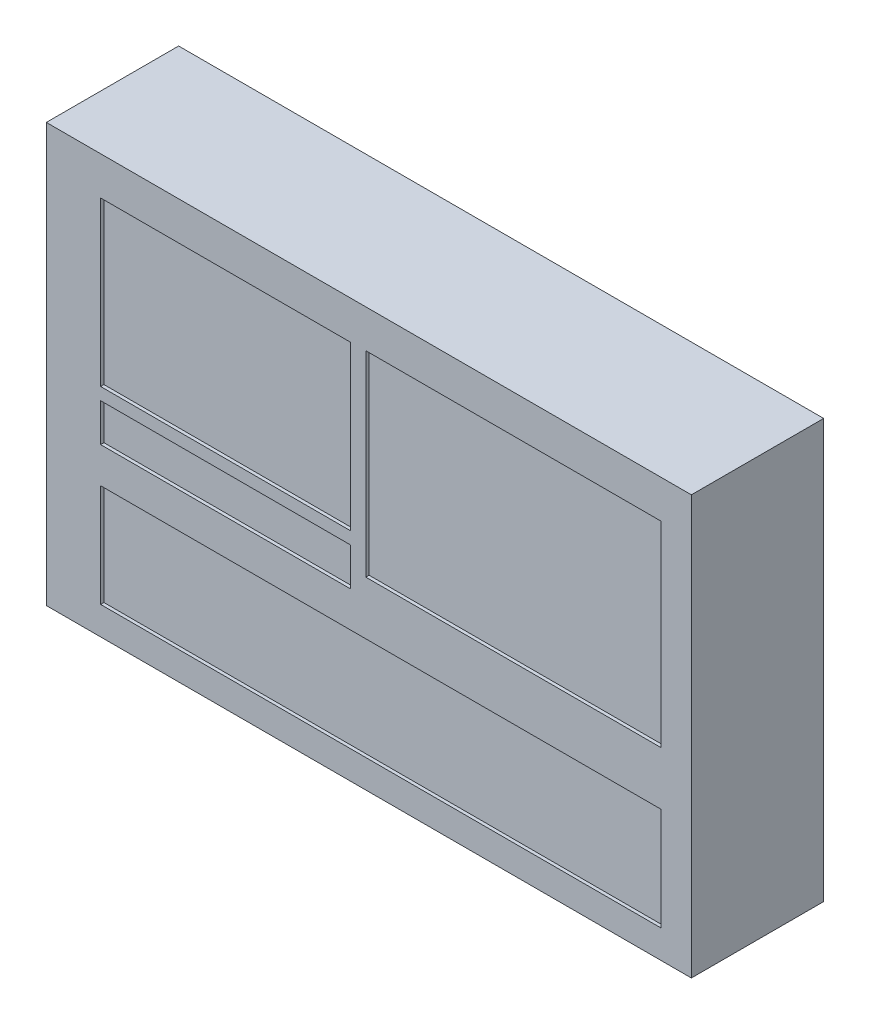
ISO-10303-21;
HEADER;
FILE_DESCRIPTION(('STEP AP214'),'2;1');
FILE_NAME('part.step','',(''),(''),'','','');
FILE_SCHEMA(('AUTOMOTIVE_DESIGN { 1 0 10303 214 1 1 1 1 }'));
ENDSEC;
DATA;
#1=APPLICATION_CONTEXT('core data for automotive mechanical design processes');
#2=APPLICATION_PROTOCOL_DEFINITION('international standard','automotive_design',2000,#1);
#3=PRODUCT_CONTEXT('',#1,'mechanical');
#4=PRODUCT('Part','Part','',(#3));
#5=PRODUCT_RELATED_PRODUCT_CATEGORY('part','',(#4));
#6=PRODUCT_DEFINITION_FORMATION('','',#4);
#7=PRODUCT_DEFINITION_CONTEXT('part definition',#1,'design');
#8=PRODUCT_DEFINITION('design','',#6,#7);
#9=PRODUCT_DEFINITION_SHAPE('','',#8);
#10=(LENGTH_UNIT() NAMED_UNIT(*) SI_UNIT(.MILLI.,.METRE.));
#11=(NAMED_UNIT(*) PLANE_ANGLE_UNIT() SI_UNIT($,.RADIAN.));
#12=(NAMED_UNIT(*) SI_UNIT($,.STERADIAN.) SOLID_ANGLE_UNIT());
#13=UNCERTAINTY_MEASURE_WITH_UNIT(LENGTH_MEASURE(1.E-05),#10,'distance_accuracy_value','');
#14=(GEOMETRIC_REPRESENTATION_CONTEXT(3) GLOBAL_UNCERTAINTY_ASSIGNED_CONTEXT((#13)) GLOBAL_UNIT_ASSIGNED_CONTEXT((#10,
#11,#12)) REPRESENTATION_CONTEXT('',''));
#15=CARTESIAN_POINT('',(0.,0.,0.));
#16=DIRECTION('',(0.,0.,1.));
#17=DIRECTION('',(1.,0.,0.));
#18=AXIS2_PLACEMENT_3D('',#15,#16,#17);
#19=CARTESIAN_POINT('',(-272.368932038835,127.47572815534,80.));
#20=DIRECTION('',(1.,0.,0.));
#21=DIRECTION('',(0.,1.,0.));
#22=AXIS2_PLACEMENT_3D('',#19,#20,#21);
#23=PLANE('',#22);
#24=DIRECTION('',(0.,-1.,0.));
#25=VECTOR('',#24,1.);
#26=CARTESIAN_POINT('',(-272.368932038835,127.47572815534,0.));
#27=LINE('',#26,#25);
#28=CARTESIAN_POINT('',(-272.368932038835,127.47572815534,0.));
#29=VERTEX_POINT('',#28);
#30=CARTESIAN_POINT('',(-272.368932038835,-125.52427184466,0.));
#31=VERTEX_POINT('',#30);
#32=EDGE_CURVE('E351',#29,#31,#27,.T.);
#33=ORIENTED_EDGE('',*,*,#32,.T.);
#34=DIRECTION('',(0.,0.,-1.));
#35=VECTOR('',#34,1.);
#36=CARTESIAN_POINT('',(-272.368932038835,-125.52427184466,80.));
#37=LINE('',#36,#35);
#38=CARTESIAN_POINT('',(-272.368932038835,-125.52427184466,80.));
#39=VERTEX_POINT('',#38);
#40=EDGE_CURVE('E11',#39,#31,#37,.T.);
#41=ORIENTED_EDGE('',*,*,#40,.F.);
#42=DIRECTION('',(0.,-1.,0.));
#43=VECTOR('',#42,1.);
#44=CARTESIAN_POINT('',(-272.368932038835,127.47572815534,80.));
#45=LINE('',#44,#43);
#46=CARTESIAN_POINT('',(-272.368932038835,127.47572815534,80.));
#47=VERTEX_POINT('',#46);
#48=EDGE_CURVE('E361',#47,#39,#45,.T.);
#49=ORIENTED_EDGE('',*,*,#48,.F.);
#50=DIRECTION('',(0.,0.,-1.));
#51=VECTOR('',#50,1.);
#52=CARTESIAN_POINT('',(-272.368932038835,127.47572815534,80.));
#53=LINE('',#52,#51);
#54=EDGE_CURVE('E375',#47,#29,#53,.T.);
#55=ORIENTED_EDGE('',*,*,#54,.T.);
#56=EDGE_LOOP('',(#33,#41,#49,#55));
#57=FACE_BOUND('',#56,.T.);
#58=ADVANCED_FACE('F41',(#57),#23,.F.);
#59=CARTESIAN_POINT('',(-272.368932038835,-125.52427184466,80.));
#60=DIRECTION('',(0.,1.,0.));
#61=DIRECTION('',(0.,0.,1.));
#62=AXIS2_PLACEMENT_3D('',#59,#60,#61);
#63=PLANE('',#62);
#64=DIRECTION('',(1.,0.,0.));
#65=VECTOR('',#64,1.);
#66=CARTESIAN_POINT('',(-272.368932038835,-125.52427184466,0.));
#67=LINE('',#66,#65);
#68=CARTESIAN_POINT('',(117.631067961165,-125.52427184466,0.));
#69=VERTEX_POINT('',#68);
#70=EDGE_CURVE('E379',#31,#69,#67,.T.);
#71=ORIENTED_EDGE('',*,*,#70,.T.);
#72=DIRECTION('',(0.,0.,-1.));
#73=VECTOR('',#72,1.);
#74=CARTESIAN_POINT('',(117.631067961165,-125.52427184466,80.));
#75=LINE('',#74,#73);
#76=CARTESIAN_POINT('',(117.631067961165,-125.52427184466,80.));
#77=VERTEX_POINT('',#76);
#78=EDGE_CURVE('E49',#77,#69,#75,.T.);
#79=ORIENTED_EDGE('',*,*,#78,.F.);
#80=DIRECTION('',(1.,0.,0.));
#81=VECTOR('',#80,1.);
#82=CARTESIAN_POINT('',(-272.368932038835,-125.52427184466,80.));
#83=LINE('',#82,#81);
#84=EDGE_CURVE('E365',#39,#77,#83,.T.);
#85=ORIENTED_EDGE('',*,*,#84,.F.);
#86=ORIENTED_EDGE('',*,*,#40,.T.);
#87=EDGE_LOOP('',(#71,#79,#85,#86));
#88=FACE_BOUND('',#87,.T.);
#89=ADVANCED_FACE('F415',(#88),#63,.F.);
#90=CARTESIAN_POINT('',(117.631067961165,127.47572815534,80.));
#91=DIRECTION('',(-1.,0.,0.));
#92=DIRECTION('',(0.,-1.,0.));
#93=AXIS2_PLACEMENT_3D('',#90,#91,#92);
#94=PLANE('',#93);
#95=DIRECTION('',(0.,1.,0.));
#96=VECTOR('',#95,1.);
#97=CARTESIAN_POINT('',(117.631067961165,127.47572815534,0.));
#98=LINE('',#97,#96);
#99=CARTESIAN_POINT('',(117.631067961165,127.47572815534,0.));
#100=VERTEX_POINT('',#99);
#101=EDGE_CURVE('E382',#69,#100,#98,.T.);
#102=ORIENTED_EDGE('',*,*,#101,.T.);
#103=DIRECTION('',(0.,0.,-1.));
#104=VECTOR('',#103,1.);
#105=CARTESIAN_POINT('',(117.631067961165,127.47572815534,80.));
#106=LINE('',#105,#104);
#107=CARTESIAN_POINT('',(117.631067961165,127.47572815534,80.));
#108=VERTEX_POINT('',#107);
#109=EDGE_CURVE('E390',#108,#100,#106,.T.);
#110=ORIENTED_EDGE('',*,*,#109,.F.);
#111=DIRECTION('',(0.,1.,0.));
#112=VECTOR('',#111,1.);
#113=CARTESIAN_POINT('',(117.631067961165,127.47572815534,80.));
#114=LINE('',#113,#112);
#115=EDGE_CURVE('E369',#77,#108,#114,.T.);
#116=ORIENTED_EDGE('',*,*,#115,.F.);
#117=ORIENTED_EDGE('',*,*,#78,.T.);
#118=EDGE_LOOP('',(#102,#110,#116,#117));
#119=FACE_BOUND('',#118,.T.);
#120=ADVANCED_FACE('F399',(#119),#94,.F.);
#121=CARTESIAN_POINT('',(-272.368932038835,127.47572815534,80.));
#122=DIRECTION('',(0.,-1.,0.));
#123=DIRECTION('',(0.,0.,-1.));
#124=AXIS2_PLACEMENT_3D('',#121,#122,#123);
#125=PLANE('',#124);
#126=DIRECTION('',(-1.,0.,0.));
#127=VECTOR('',#126,1.);
#128=CARTESIAN_POINT('',(-272.368932038835,127.47572815534,0.));
#129=LINE('',#128,#127);
#130=EDGE_CURVE('E366',#100,#29,#129,.T.);
#131=ORIENTED_EDGE('',*,*,#130,.T.);
#132=ORIENTED_EDGE('',*,*,#54,.F.);
#133=DIRECTION('',(-1.,0.,0.));
#134=VECTOR('',#133,1.);
#135=CARTESIAN_POINT('',(-272.368932038835,127.47572815534,80.));
#136=LINE('',#135,#134);
#137=EDGE_CURVE('E372',#108,#47,#136,.T.);
#138=ORIENTED_EDGE('',*,*,#137,.F.);
#139=ORIENTED_EDGE('',*,*,#109,.T.);
#140=EDGE_LOOP('',(#131,#132,#138,#139));
#141=FACE_BOUND('',#140,.T.);
#142=ADVANCED_FACE('F408',(#141),#125,.F.);
#143=CARTESIAN_POINT('',(0.,0.,80.));
#144=DIRECTION('',(0.,0.,1.));
#145=DIRECTION('',(1.,0.,0.));
#146=AXIS2_PLACEMENT_3D('',#143,#144,#145);
#147=PLANE('',#146);
#148=DIRECTION('',(0.,-1.,0.));
#149=VECTOR('',#148,1.);
#150=CARTESIAN_POINT('',(-79.2244882467299,104.51576455588,80.));
#151=LINE('',#150,#149);
#152=CARTESIAN_POINT('',(-79.2244882467299,104.51576455588,80.));
#153=VERTEX_POINT('',#152);
#154=CARTESIAN_POINT('',(-79.2244882467299,-14.0542771286093,80.));
#155=VERTEX_POINT('',#154);
#156=EDGE_CURVE('E56',#153,#155,#151,.T.);
#157=ORIENTED_EDGE('',*,*,#156,.F.);
#158=DIRECTION('',(-1.,0.,0.));
#159=VECTOR('',#158,1.);
#160=CARTESIAN_POINT('',(-79.2244882467299,104.51576455588,80.));
#161=LINE('',#160,#159);
#162=CARTESIAN_POINT('',(99.2800189527677,104.51576455588,80.));
#163=VERTEX_POINT('',#162);
#164=EDGE_CURVE('E237',#163,#153,#161,.T.);
#165=ORIENTED_EDGE('',*,*,#164,.F.);
#166=DIRECTION('',(0.,1.,0.));
#167=VECTOR('',#166,1.);
#168=CARTESIAN_POINT('',(99.2800189527677,104.51576455588,80.));
#169=LINE('',#168,#167);
#170=CARTESIAN_POINT('',(99.2800189527677,-14.0542771286093,80.));
#171=VERTEX_POINT('',#170);
#172=EDGE_CURVE('E257',#171,#163,#169,.T.);
#173=ORIENTED_EDGE('',*,*,#172,.F.);
#174=DIRECTION('',(1.,0.,0.));
#175=VECTOR('',#174,1.);
#176=CARTESIAN_POINT('',(-79.2244882467299,-14.0542771286093,80.));
#177=LINE('',#176,#175);
#178=EDGE_CURVE('E252',#155,#171,#177,.T.);
#179=ORIENTED_EDGE('',*,*,#178,.F.);
#180=EDGE_LOOP('',(#157,#165,#173,#179));
#181=FACE_BOUND('',#180,.T.);
#182=DIRECTION('',(0.,-1.,0.));
#183=VECTOR('',#182,1.);
#184=CARTESIAN_POINT('',(-239.544544608857,-46.340955145982,80.));
#185=LINE('',#184,#183);
#186=CARTESIAN_POINT('',(-239.544544608857,-46.340955145982,80.));
#187=VERTEX_POINT('',#186);
#188=CARTESIAN_POINT('',(-239.544544608857,-108.502088110464,80.));
#189=VERTEX_POINT('',#188);
#190=EDGE_CURVE('E64',#187,#189,#185,.T.);
#191=ORIENTED_EDGE('',*,*,#190,.F.);
#192=DIRECTION('',(-1.,0.,0.));
#193=VECTOR('',#192,1.);
#194=CARTESIAN_POINT('',(-239.544544608857,-46.340955145982,80.));
#195=LINE('',#194,#193);
#196=CARTESIAN_POINT('',(99.2800189527677,-46.340955145982,80.));
#197=VERTEX_POINT('',#196);
#198=EDGE_CURVE('E281',#197,#187,#195,.T.);
#199=ORIENTED_EDGE('',*,*,#198,.F.);
#200=DIRECTION('',(0.,1.,0.));
#201=VECTOR('',#200,1.);
#202=CARTESIAN_POINT('',(99.2800189527677,-46.340955145982,80.));
#203=LINE('',#202,#201);
#204=CARTESIAN_POINT('',(99.2800189527677,-108.502088110464,80.));
#205=VERTEX_POINT('',#204);
#206=EDGE_CURVE('E300',#205,#197,#203,.T.);
#207=ORIENTED_EDGE('',*,*,#206,.F.);
#208=DIRECTION('',(1.,0.,0.));
#209=VECTOR('',#208,1.);
#210=CARTESIAN_POINT('',(-239.544544608857,-108.502088110464,80.));
#211=LINE('',#210,#209);
#212=EDGE_CURVE('E296',#189,#205,#211,.T.);
#213=ORIENTED_EDGE('',*,*,#212,.F.);
#214=EDGE_LOOP('',(#191,#199,#207,#213));
#215=FACE_BOUND('',#214,.T.);
#216=DIRECTION('',(0.,-1.,0.));
#217=VECTOR('',#216,1.);
#218=CARTESIAN_POINT('',(-239.544544608857,-1.80760615650238,80.));
#219=LINE('',#218,#217);
#220=CARTESIAN_POINT('',(-239.544544608857,-1.80760615650238,80.));
#221=VERTEX_POINT('',#220);
#222=CARTESIAN_POINT('',(-239.544544608857,-24.8165031344002,80.));
#223=VERTEX_POINT('',#222);
#224=EDGE_CURVE('E185',#221,#223,#219,.T.);
#225=ORIENTED_EDGE('',*,*,#224,.F.);
#226=DIRECTION('',(-1.,0.,0.));
#227=VECTOR('',#226,1.);
#228=CARTESIAN_POINT('',(-239.544544608857,-1.80760615650238,80.));
#229=LINE('',#228,#227);
#230=CARTESIAN_POINT('',(-88.3167136654153,-1.80760615650238,80.));
#231=VERTEX_POINT('',#230);
#232=EDGE_CURVE('E205',#231,#221,#229,.T.);
#233=ORIENTED_EDGE('',*,*,#232,.F.);
#234=DIRECTION('',(0.,1.,0.));
#235=VECTOR('',#234,1.);
#236=CARTESIAN_POINT('',(-88.3167136654153,-1.80760615650238,80.));
#237=LINE('',#236,#235);
#238=CARTESIAN_POINT('',(-88.3167136654153,-24.8165031344002,80.));
#239=VERTEX_POINT('',#238);
#240=EDGE_CURVE('E209',#239,#231,#237,.T.);
#241=ORIENTED_EDGE('',*,*,#240,.F.);
#242=DIRECTION('',(1.,0.,0.));
#243=VECTOR('',#242,1.);
#244=CARTESIAN_POINT('',(-239.544544608857,-24.8165031344002,80.));
#245=LINE('',#244,#243);
#246=EDGE_CURVE('E218',#223,#239,#245,.T.);
#247=ORIENTED_EDGE('',*,*,#246,.F.);
#248=EDGE_LOOP('',(#225,#233,#241,#247));
#249=FACE_BOUND('',#248,.T.);
#250=DIRECTION('',(0.,-1.,0.));
#251=VECTOR('',#250,1.);
#252=CARTESIAN_POINT('',(-239.544544608857,104.330208935091,80.));
#253=LINE('',#252,#251);
#254=CARTESIAN_POINT('',(-239.544544608857,104.330208935091,80.));
#255=VERTEX_POINT('',#254);
#256=CARTESIAN_POINT('',(-239.544544608857,5.61461867507757,80.));
#257=VERTEX_POINT('',#256);
#258=EDGE_CURVE('E267',#255,#257,#253,.T.);
#259=ORIENTED_EDGE('',*,*,#258,.F.);
#260=DIRECTION('',(-1.,0.,0.));
#261=VECTOR('',#260,1.);
#262=CARTESIAN_POINT('',(-239.544544608857,104.330208935091,80.));
#263=LINE('',#262,#261);
#264=CARTESIAN_POINT('',(-88.3167136654153,104.330208935091,80.));
#265=VERTEX_POINT('',#264);
#266=EDGE_CURVE('E322',#265,#255,#263,.T.);
#267=ORIENTED_EDGE('',*,*,#266,.F.);
#268=DIRECTION('',(0.,1.,0.));
#269=VECTOR('',#268,1.);
#270=CARTESIAN_POINT('',(-88.3167136654153,104.330208935091,80.));
#271=LINE('',#270,#269);
#272=CARTESIAN_POINT('',(-88.3167136654153,5.61461867507757,80.));
#273=VERTEX_POINT('',#272);
#274=EDGE_CURVE('E341',#273,#265,#271,.T.);
#275=ORIENTED_EDGE('',*,*,#274,.F.);
#276=DIRECTION('',(1.,0.,0.));
#277=VECTOR('',#276,1.);
#278=CARTESIAN_POINT('',(-239.544544608857,5.61461867507757,80.));
#279=LINE('',#278,#277);
#280=EDGE_CURVE('E337',#257,#273,#279,.T.);
#281=ORIENTED_EDGE('',*,*,#280,.F.);
#282=EDGE_LOOP('',(#259,#267,#275,#281));
#283=FACE_BOUND('',#282,.T.);
#284=ORIENTED_EDGE('',*,*,#48,.T.);
#285=ORIENTED_EDGE('',*,*,#84,.T.);
#286=ORIENTED_EDGE('',*,*,#115,.T.);
#287=ORIENTED_EDGE('',*,*,#137,.T.);
#288=EDGE_LOOP('',(#284,#285,#286,#287));
#289=FACE_BOUND('',#288,.T.);
#290=ADVANCED_FACE('F414',(#181,#215,#249,#283,#289),#147,.T.);
#291=CARTESIAN_POINT('',(0.,0.,0.));
#292=DIRECTION('',(0.,0.,1.));
#293=DIRECTION('',(1.,0.,0.));
#294=AXIS2_PLACEMENT_3D('',#291,#292,#293);
#295=PLANE('',#294);
#296=ORIENTED_EDGE('',*,*,#32,.F.);
#297=ORIENTED_EDGE('',*,*,#130,.F.);
#298=ORIENTED_EDGE('',*,*,#101,.F.);
#299=ORIENTED_EDGE('',*,*,#70,.F.);
#300=EDGE_LOOP('',(#296,#297,#298,#299));
#301=FACE_BOUND('',#300,.T.);
#302=ADVANCED_FACE('F405',(#301),#295,.F.);
#303=CARTESIAN_POINT('',(-239.544544608857,104.330208935091,78.));
#304=DIRECTION('',(-1.,0.,0.));
#305=DIRECTION('',(0.,0.,1.));
#306=AXIS2_PLACEMENT_3D('',#303,#304,#305);
#307=PLANE('',#306);
#308=ORIENTED_EDGE('',*,*,#258,.T.);
#309=DIRECTION('',(0.,0.,1.));
#310=VECTOR('',#309,1.);
#311=CARTESIAN_POINT('',(-239.544544608857,5.61461867507757,78.));
#312=LINE('',#311,#310);
#313=CARTESIAN_POINT('',(-239.544544608857,5.61461867507757,78.));
#314=VERTEX_POINT('',#313);
#315=EDGE_CURVE('E334',#314,#257,#312,.T.);
#316=ORIENTED_EDGE('',*,*,#315,.F.);
#317=DIRECTION('',(0.,-1.,0.));
#318=VECTOR('',#317,1.);
#319=CARTESIAN_POINT('',(-239.544544608857,104.330208935091,78.));
#320=LINE('',#319,#318);
#321=CARTESIAN_POINT('',(-239.544544608857,104.330208935091,78.));
#322=VERTEX_POINT('',#321);
#323=EDGE_CURVE('E317',#322,#314,#320,.T.);
#324=ORIENTED_EDGE('',*,*,#323,.F.);
#325=DIRECTION('',(0.,0.,1.));
#326=VECTOR('',#325,1.);
#327=CARTESIAN_POINT('',(-239.544544608857,104.330208935091,78.));
#328=LINE('',#327,#326);
#329=EDGE_CURVE('E348',#322,#255,#328,.T.);
#330=ORIENTED_EDGE('',*,*,#329,.T.);
#331=EDGE_LOOP('',(#308,#316,#324,#330));
#332=FACE_BOUND('',#331,.T.);
#333=ADVANCED_FACE('F427',(#332),#307,.F.);
#334=CARTESIAN_POINT('',(-239.544544608857,104.330208935091,78.));
#335=DIRECTION('',(0.,1.,0.));
#336=DIRECTION('',(0.,0.,1.));
#337=AXIS2_PLACEMENT_3D('',#334,#335,#336);
#338=PLANE('',#337);
#339=ORIENTED_EDGE('',*,*,#266,.T.);
#340=ORIENTED_EDGE('',*,*,#329,.F.);
#341=DIRECTION('',(-1.,0.,0.));
#342=VECTOR('',#341,1.);
#343=CARTESIAN_POINT('',(-239.544544608857,104.330208935091,78.));
#344=LINE('',#343,#342);
#345=CARTESIAN_POINT('',(-88.3167136654153,104.330208935091,78.));
#346=VERTEX_POINT('',#345);
#347=EDGE_CURVE('E330',#346,#322,#344,.T.);
#348=ORIENTED_EDGE('',*,*,#347,.F.);
#349=DIRECTION('',(0.,0.,1.));
#350=VECTOR('',#349,1.);
#351=CARTESIAN_POINT('',(-88.3167136654153,104.330208935091,78.));
#352=LINE('',#351,#350);
#353=EDGE_CURVE('E352',#346,#265,#352,.T.);
#354=ORIENTED_EDGE('',*,*,#353,.T.);
#355=EDGE_LOOP('',(#339,#340,#348,#354));
#356=FACE_BOUND('',#355,.T.);
#357=ADVANCED_FACE('F433',(#356),#338,.F.);
#358=CARTESIAN_POINT('',(-88.3167136654153,104.330208935091,78.));
#359=DIRECTION('',(1.,0.,0.));
#360=DIRECTION('',(0.,0.,-1.));
#361=AXIS2_PLACEMENT_3D('',#358,#359,#360);
#362=PLANE('',#361);
#363=ORIENTED_EDGE('',*,*,#274,.T.);
#364=ORIENTED_EDGE('',*,*,#353,.F.);
#365=DIRECTION('',(0.,1.,0.));
#366=VECTOR('',#365,1.);
#367=CARTESIAN_POINT('',(-88.3167136654153,104.330208935091,78.));
#368=LINE('',#367,#366);
#369=CARTESIAN_POINT('',(-88.3167136654153,5.61461867507757,78.));
#370=VERTEX_POINT('',#369);
#371=EDGE_CURVE('E326',#370,#346,#368,.T.);
#372=ORIENTED_EDGE('',*,*,#371,.F.);
#373=DIRECTION('',(0.,0.,1.));
#374=VECTOR('',#373,1.);
#375=CARTESIAN_POINT('',(-88.3167136654153,5.61461867507757,78.));
#376=LINE('',#375,#374);
#377=EDGE_CURVE('E355',#370,#273,#376,.T.);
#378=ORIENTED_EDGE('',*,*,#377,.T.);
#379=EDGE_LOOP('',(#363,#364,#372,#378));
#380=FACE_BOUND('',#379,.T.);
#381=ADVANCED_FACE('F439',(#380),#362,.F.);
#382=CARTESIAN_POINT('',(-239.544544608857,5.61461867507757,78.));
#383=DIRECTION('',(0.,-1.,0.));
#384=DIRECTION('',(0.,0.,-1.));
#385=AXIS2_PLACEMENT_3D('',#382,#383,#384);
#386=PLANE('',#385);
#387=ORIENTED_EDGE('',*,*,#280,.T.);
#388=ORIENTED_EDGE('',*,*,#377,.F.);
#389=DIRECTION('',(1.,0.,0.));
#390=VECTOR('',#389,1.);
#391=CARTESIAN_POINT('',(-239.544544608857,5.61461867507757,78.));
#392=LINE('',#391,#390);
#393=EDGE_CURVE('E321',#314,#370,#392,.T.);
#394=ORIENTED_EDGE('',*,*,#393,.F.);
#395=ORIENTED_EDGE('',*,*,#315,.T.);
#396=EDGE_LOOP('',(#387,#388,#394,#395));
#397=FACE_BOUND('',#396,.T.);
#398=ADVANCED_FACE('F435',(#397),#386,.F.);
#399=CARTESIAN_POINT('',(0.,0.,78.));
#400=DIRECTION('',(0.,0.,1.));
#401=DIRECTION('',(1.,0.,0.));
#402=AXIS2_PLACEMENT_3D('',#399,#400,#401);
#403=PLANE('',#402);
#404=ORIENTED_EDGE('',*,*,#323,.T.);
#405=ORIENTED_EDGE('',*,*,#393,.T.);
#406=ORIENTED_EDGE('',*,*,#371,.T.);
#407=ORIENTED_EDGE('',*,*,#347,.T.);
#408=EDGE_LOOP('',(#404,#405,#406,#407));
#409=FACE_BOUND('',#408,.T.);
#410=ADVANCED_FACE('F438',(#409),#403,.T.);
#411=CARTESIAN_POINT('',(-239.544544608857,-1.80760615650238,78.));
#412=DIRECTION('',(-1.,0.,0.));
#413=DIRECTION('',(0.,0.,1.));
#414=AXIS2_PLACEMENT_3D('',#411,#412,#413);
#415=PLANE('',#414);
#416=ORIENTED_EDGE('',*,*,#224,.T.);
#417=DIRECTION('',(0.,0.,1.));
#418=VECTOR('',#417,1.);
#419=CARTESIAN_POINT('',(-239.544544608857,-24.8165031344002,78.));
#420=LINE('',#419,#418);
#421=CARTESIAN_POINT('',(-239.544544608857,-24.8165031344002,78.));
#422=VERTEX_POINT('',#421);
#423=EDGE_CURVE('E178',#422,#223,#420,.T.);
#424=ORIENTED_EDGE('',*,*,#423,.F.);
#425=DIRECTION('',(0.,-1.,0.));
#426=VECTOR('',#425,1.);
#427=CARTESIAN_POINT('',(-239.544544608857,-1.80760615650238,78.));
#428=LINE('',#427,#426);
#429=CARTESIAN_POINT('',(-239.544544608857,-1.80760615650238,78.));
#430=VERTEX_POINT('',#429);
#431=EDGE_CURVE('E182',#430,#422,#428,.T.);
#432=ORIENTED_EDGE('',*,*,#431,.F.);
#433=DIRECTION('',(0.,0.,1.));
#434=VECTOR('',#433,1.);
#435=CARTESIAN_POINT('',(-239.544544608857,-1.80760615650238,78.));
#436=LINE('',#435,#434);
#437=EDGE_CURVE('E224',#430,#221,#436,.T.);
#438=ORIENTED_EDGE('',*,*,#437,.T.);
#439=EDGE_LOOP('',(#416,#424,#432,#438));
#440=FACE_BOUND('',#439,.T.);
#441=ADVANCED_FACE('F180',(#440),#415,.F.);
#442=CARTESIAN_POINT('',(-239.544544608857,-1.80760615650238,78.));
#443=DIRECTION('',(0.,1.,0.));
#444=DIRECTION('',(0.,0.,1.));
#445=AXIS2_PLACEMENT_3D('',#442,#443,#444);
#446=PLANE('',#445);
#447=ORIENTED_EDGE('',*,*,#232,.T.);
#448=ORIENTED_EDGE('',*,*,#437,.F.);
#449=DIRECTION('',(-1.,0.,0.));
#450=VECTOR('',#449,1.);
#451=CARTESIAN_POINT('',(-239.544544608857,-1.80760615650238,78.));
#452=LINE('',#451,#450);
#453=CARTESIAN_POINT('',(-88.3167136654153,-1.80760615650238,78.));
#454=VERTEX_POINT('',#453);
#455=EDGE_CURVE('E191',#454,#430,#452,.T.);
#456=ORIENTED_EDGE('',*,*,#455,.F.);
#457=DIRECTION('',(0.,0.,1.));
#458=VECTOR('',#457,1.);
#459=CARTESIAN_POINT('',(-88.3167136654153,-1.80760615650238,78.));
#460=LINE('',#459,#458);
#461=EDGE_CURVE('E227',#454,#231,#460,.T.);
#462=ORIENTED_EDGE('',*,*,#461,.T.);
#463=EDGE_LOOP('',(#447,#448,#456,#462));
#464=FACE_BOUND('',#463,.T.);
#465=ADVANCED_FACE('F490',(#464),#446,.F.);
#466=CARTESIAN_POINT('',(-88.3167136654153,-1.80760615650238,78.));
#467=DIRECTION('',(1.,0.,0.));
#468=DIRECTION('',(0.,0.,-1.));
#469=AXIS2_PLACEMENT_3D('',#466,#467,#468);
#470=PLANE('',#469);
#471=ORIENTED_EDGE('',*,*,#240,.T.);
#472=ORIENTED_EDGE('',*,*,#461,.F.);
#473=DIRECTION('',(0.,1.,0.));
#474=VECTOR('',#473,1.);
#475=CARTESIAN_POINT('',(-88.3167136654153,-1.80760615650238,78.));
#476=LINE('',#475,#474);
#477=CARTESIAN_POINT('',(-88.3167136654153,-24.8165031344002,78.));
#478=VERTEX_POINT('',#477);
#479=EDGE_CURVE('E200',#478,#454,#476,.T.);
#480=ORIENTED_EDGE('',*,*,#479,.F.);
#481=DIRECTION('',(0.,0.,1.));
#482=VECTOR('',#481,1.);
#483=CARTESIAN_POINT('',(-88.3167136654153,-24.8165031344002,78.));
#484=LINE('',#483,#482);
#485=EDGE_CURVE('E190',#478,#239,#484,.T.);
#486=ORIENTED_EDGE('',*,*,#485,.T.);
#487=EDGE_LOOP('',(#471,#472,#480,#486));
#488=FACE_BOUND('',#487,.T.);
#489=ADVANCED_FACE('F493',(#488),#470,.F.);
#490=CARTESIAN_POINT('',(-239.544544608857,-24.8165031344002,78.));
#491=DIRECTION('',(0.,-1.,0.));
#492=DIRECTION('',(0.,0.,-1.));
#493=AXIS2_PLACEMENT_3D('',#490,#491,#492);
#494=PLANE('',#493);
#495=ORIENTED_EDGE('',*,*,#246,.T.);
#496=ORIENTED_EDGE('',*,*,#485,.F.);
#497=DIRECTION('',(1.,0.,0.));
#498=VECTOR('',#497,1.);
#499=CARTESIAN_POINT('',(-239.544544608857,-24.8165031344002,78.));
#500=LINE('',#499,#498);
#501=EDGE_CURVE('E194',#422,#478,#500,.T.);
#502=ORIENTED_EDGE('',*,*,#501,.F.);
#503=ORIENTED_EDGE('',*,*,#423,.T.);
#504=EDGE_LOOP('',(#495,#496,#502,#503));
#505=FACE_BOUND('',#504,.T.);
#506=ADVANCED_FACE('F195',(#505),#494,.F.);
#507=CARTESIAN_POINT('',(0.,0.,78.));
#508=DIRECTION('',(0.,0.,1.));
#509=DIRECTION('',(1.,0.,0.));
#510=AXIS2_PLACEMENT_3D('',#507,#508,#509);
#511=PLANE('',#510);
#512=ORIENTED_EDGE('',*,*,#431,.T.);
#513=ORIENTED_EDGE('',*,*,#501,.T.);
#514=ORIENTED_EDGE('',*,*,#479,.T.);
#515=ORIENTED_EDGE('',*,*,#455,.T.);
#516=EDGE_LOOP('',(#512,#513,#514,#515));
#517=FACE_BOUND('',#516,.T.);
#518=ADVANCED_FACE('F202',(#517),#511,.T.);
#519=CARTESIAN_POINT('',(-239.544544608857,-46.340955145982,78.));
#520=DIRECTION('',(-1.,0.,0.));
#521=DIRECTION('',(0.,0.,1.));
#522=AXIS2_PLACEMENT_3D('',#519,#520,#521);
#523=PLANE('',#522);
#524=ORIENTED_EDGE('',*,*,#190,.T.);
#525=DIRECTION('',(0.,0.,1.));
#526=VECTOR('',#525,1.);
#527=CARTESIAN_POINT('',(-239.544544608857,-108.502088110464,78.));
#528=LINE('',#527,#526);
#529=CARTESIAN_POINT('',(-239.544544608857,-108.502088110464,78.));
#530=VERTEX_POINT('',#529);
#531=EDGE_CURVE('E293',#530,#189,#528,.T.);
#532=ORIENTED_EDGE('',*,*,#531,.F.);
#533=DIRECTION('',(0.,-1.,0.));
#534=VECTOR('',#533,1.);
#535=CARTESIAN_POINT('',(-239.544544608857,-46.340955145982,78.));
#536=LINE('',#535,#534);
#537=CARTESIAN_POINT('',(-239.544544608857,-46.340955145982,78.));
#538=VERTEX_POINT('',#537);
#539=EDGE_CURVE('E276',#538,#530,#536,.T.);
#540=ORIENTED_EDGE('',*,*,#539,.F.);
#541=DIRECTION('',(0.,0.,1.));
#542=VECTOR('',#541,1.);
#543=CARTESIAN_POINT('',(-239.544544608857,-46.340955145982,78.));
#544=LINE('',#543,#542);
#545=EDGE_CURVE('E253',#538,#187,#544,.T.);
#546=ORIENTED_EDGE('',*,*,#545,.T.);
#547=EDGE_LOOP('',(#524,#532,#540,#546));
#548=FACE_BOUND('',#547,.T.);
#549=ADVANCED_FACE('F450',(#548),#523,.F.);
#550=CARTESIAN_POINT('',(-239.544544608857,-46.340955145982,78.));
#551=DIRECTION('',(0.,1.,0.));
#552=DIRECTION('',(0.,0.,1.));
#553=AXIS2_PLACEMENT_3D('',#550,#551,#552);
#554=PLANE('',#553);
#555=ORIENTED_EDGE('',*,*,#198,.T.);
#556=ORIENTED_EDGE('',*,*,#545,.F.);
#557=DIRECTION('',(-1.,0.,0.));
#558=VECTOR('',#557,1.);
#559=CARTESIAN_POINT('',(-239.544544608857,-46.340955145982,78.));
#560=LINE('',#559,#558);
#561=CARTESIAN_POINT('',(99.2800189527677,-46.340955145982,78.));
#562=VERTEX_POINT('',#561);
#563=EDGE_CURVE('E289',#562,#538,#560,.T.);
#564=ORIENTED_EDGE('',*,*,#563,.F.);
#565=DIRECTION('',(0.,0.,1.));
#566=VECTOR('',#565,1.);
#567=CARTESIAN_POINT('',(99.2800189527677,-46.340955145982,78.));
#568=LINE('',#567,#566);
#569=EDGE_CURVE('E309',#562,#197,#568,.T.);
#570=ORIENTED_EDGE('',*,*,#569,.T.);
#571=EDGE_LOOP('',(#555,#556,#564,#570));
#572=FACE_BOUND('',#571,.T.);
#573=ADVANCED_FACE('F453',(#572),#554,.F.);
#574=CARTESIAN_POINT('',(99.2800189527677,-46.340955145982,78.));
#575=DIRECTION('',(1.,0.,0.));
#576=DIRECTION('',(0.,0.,-1.));
#577=AXIS2_PLACEMENT_3D('',#574,#575,#576);
#578=PLANE('',#577);
#579=ORIENTED_EDGE('',*,*,#206,.T.);
#580=ORIENTED_EDGE('',*,*,#569,.F.);
#581=DIRECTION('',(0.,1.,0.));
#582=VECTOR('',#581,1.);
#583=CARTESIAN_POINT('',(99.2800189527677,-46.340955145982,78.));
#584=LINE('',#583,#582);
#585=CARTESIAN_POINT('',(99.2800189527677,-108.502088110464,78.));
#586=VERTEX_POINT('',#585);
#587=EDGE_CURVE('E285',#586,#562,#584,.T.);
#588=ORIENTED_EDGE('',*,*,#587,.F.);
#589=DIRECTION('',(0.,0.,1.));
#590=VECTOR('',#589,1.);
#591=CARTESIAN_POINT('',(99.2800189527677,-108.502088110464,78.));
#592=LINE('',#591,#590);
#593=EDGE_CURVE('E312',#586,#205,#592,.T.);
#594=ORIENTED_EDGE('',*,*,#593,.T.);
#595=EDGE_LOOP('',(#579,#580,#588,#594));
#596=FACE_BOUND('',#595,.T.);
#597=ADVANCED_FACE('F458',(#596),#578,.F.);
#598=CARTESIAN_POINT('',(-239.544544608857,-108.502088110464,78.));
#599=DIRECTION('',(0.,-1.,0.));
#600=DIRECTION('',(0.,0.,-1.));
#601=AXIS2_PLACEMENT_3D('',#598,#599,#600);
#602=PLANE('',#601);
#603=ORIENTED_EDGE('',*,*,#212,.T.);
#604=ORIENTED_EDGE('',*,*,#593,.F.);
#605=DIRECTION('',(1.,0.,0.));
#606=VECTOR('',#605,1.);
#607=CARTESIAN_POINT('',(-239.544544608857,-108.502088110464,78.));
#608=LINE('',#607,#606);
#609=EDGE_CURVE('E280',#530,#586,#608,.T.);
#610=ORIENTED_EDGE('',*,*,#609,.F.);
#611=ORIENTED_EDGE('',*,*,#531,.T.);
#612=EDGE_LOOP('',(#603,#604,#610,#611));
#613=FACE_BOUND('',#612,.T.);
#614=ADVANCED_FACE('F454',(#613),#602,.F.);
#615=CARTESIAN_POINT('',(0.,0.,78.));
#616=DIRECTION('',(0.,0.,1.));
#617=DIRECTION('',(1.,0.,0.));
#618=AXIS2_PLACEMENT_3D('',#615,#616,#617);
#619=PLANE('',#618);
#620=ORIENTED_EDGE('',*,*,#539,.T.);
#621=ORIENTED_EDGE('',*,*,#609,.T.);
#622=ORIENTED_EDGE('',*,*,#587,.T.);
#623=ORIENTED_EDGE('',*,*,#563,.T.);
#624=EDGE_LOOP('',(#620,#621,#622,#623));
#625=FACE_BOUND('',#624,.T.);
#626=ADVANCED_FACE('F457',(#625),#619,.T.);
#627=CARTESIAN_POINT('',(-79.2244882467299,104.51576455588,78.));
#628=DIRECTION('',(-1.,0.,0.));
#629=DIRECTION('',(0.,0.,1.));
#630=AXIS2_PLACEMENT_3D('',#627,#628,#629);
#631=PLANE('',#630);
#632=ORIENTED_EDGE('',*,*,#156,.T.);
#633=DIRECTION('',(0.,0.,1.));
#634=VECTOR('',#633,1.);
#635=CARTESIAN_POINT('',(-79.2244882467299,-14.0542771286093,78.));
#636=LINE('',#635,#634);
#637=CARTESIAN_POINT('',(-79.2244882467299,-14.0542771286093,78.));
#638=VERTEX_POINT('',#637);
#639=EDGE_CURVE('E249',#638,#155,#636,.T.);
#640=ORIENTED_EDGE('',*,*,#639,.F.);
#641=DIRECTION('',(0.,-1.,0.));
#642=VECTOR('',#641,1.);
#643=CARTESIAN_POINT('',(-79.2244882467299,104.51576455588,78.));
#644=LINE('',#643,#642);
#645=CARTESIAN_POINT('',(-79.2244882467299,104.51576455588,78.));
#646=VERTEX_POINT('',#645);
#647=EDGE_CURVE('E232',#646,#638,#644,.T.);
#648=ORIENTED_EDGE('',*,*,#647,.F.);
#649=DIRECTION('',(0.,0.,1.));
#650=VECTOR('',#649,1.);
#651=CARTESIAN_POINT('',(-79.2244882467299,104.51576455588,78.));
#652=LINE('',#651,#650);
#653=EDGE_CURVE('E264',#646,#153,#652,.T.);
#654=ORIENTED_EDGE('',*,*,#653,.T.);
#655=EDGE_LOOP('',(#632,#640,#648,#654));
#656=FACE_BOUND('',#655,.T.);
#657=ADVANCED_FACE('F468',(#656),#631,.F.);
#658=CARTESIAN_POINT('',(-79.2244882467299,104.51576455588,78.));
#659=DIRECTION('',(0.,1.,0.));
#660=DIRECTION('',(0.,0.,1.));
#661=AXIS2_PLACEMENT_3D('',#658,#659,#660);
#662=PLANE('',#661);
#663=ORIENTED_EDGE('',*,*,#164,.T.);
#664=ORIENTED_EDGE('',*,*,#653,.F.);
#665=DIRECTION('',(-1.,0.,0.));
#666=VECTOR('',#665,1.);
#667=CARTESIAN_POINT('',(-79.2244882467299,104.51576455588,78.));
#668=LINE('',#667,#666);
#669=CARTESIAN_POINT('',(99.2800189527677,104.51576455588,78.));
#670=VERTEX_POINT('',#669);
#671=EDGE_CURVE('E245',#670,#646,#668,.T.);
#672=ORIENTED_EDGE('',*,*,#671,.F.);
#673=DIRECTION('',(0.,0.,1.));
#674=VECTOR('',#673,1.);
#675=CARTESIAN_POINT('',(99.2800189527677,104.51576455588,78.));
#676=LINE('',#675,#674);
#677=EDGE_CURVE('E268',#670,#163,#676,.T.);
#678=ORIENTED_EDGE('',*,*,#677,.T.);
#679=EDGE_LOOP('',(#663,#664,#672,#678));
#680=FACE_BOUND('',#679,.T.);
#681=ADVANCED_FACE('F472',(#680),#662,.F.);
#682=CARTESIAN_POINT('',(99.2800189527677,104.51576455588,78.));
#683=DIRECTION('',(1.,0.,0.));
#684=DIRECTION('',(0.,1.,0.));
#685=AXIS2_PLACEMENT_3D('',#682,#683,#684);
#686=PLANE('',#685);
#687=ORIENTED_EDGE('',*,*,#172,.T.);
#688=ORIENTED_EDGE('',*,*,#677,.F.);
#689=DIRECTION('',(0.,1.,0.));
#690=VECTOR('',#689,1.);
#691=CARTESIAN_POINT('',(99.2800189527677,104.51576455588,78.));
#692=LINE('',#691,#690);
#693=CARTESIAN_POINT('',(99.2800189527677,-14.0542771286093,78.));
#694=VERTEX_POINT('',#693);
#695=EDGE_CURVE('E241',#694,#670,#692,.T.);
#696=ORIENTED_EDGE('',*,*,#695,.F.);
#697=DIRECTION('',(0.,0.,1.));
#698=VECTOR('',#697,1.);
#699=CARTESIAN_POINT('',(99.2800189527677,-14.0542771286093,78.));
#700=LINE('',#699,#698);
#701=EDGE_CURVE('E271',#694,#171,#700,.T.);
#702=ORIENTED_EDGE('',*,*,#701,.T.);
#703=EDGE_LOOP('',(#687,#688,#696,#702));
#704=FACE_BOUND('',#703,.T.);
#705=ADVANCED_FACE('F477',(#704),#686,.F.);
#706=CARTESIAN_POINT('',(-79.2244882467299,-14.0542771286093,78.));
#707=DIRECTION('',(0.,-1.,0.));
#708=DIRECTION('',(0.,0.,-1.));
#709=AXIS2_PLACEMENT_3D('',#706,#707,#708);
#710=PLANE('',#709);
#711=ORIENTED_EDGE('',*,*,#178,.T.);
#712=ORIENTED_EDGE('',*,*,#701,.F.);
#713=DIRECTION('',(1.,0.,0.));
#714=VECTOR('',#713,1.);
#715=CARTESIAN_POINT('',(-79.2244882467299,-14.0542771286093,78.));
#716=LINE('',#715,#714);
#717=EDGE_CURVE('E236',#638,#694,#716,.T.);
#718=ORIENTED_EDGE('',*,*,#717,.F.);
#719=ORIENTED_EDGE('',*,*,#639,.T.);
#720=EDGE_LOOP('',(#711,#712,#718,#719));
#721=FACE_BOUND('',#720,.T.);
#722=ADVANCED_FACE('F473',(#721),#710,.F.);
#723=CARTESIAN_POINT('',(0.,0.,78.));
#724=DIRECTION('',(0.,0.,1.));
#725=DIRECTION('',(1.,0.,0.));
#726=AXIS2_PLACEMENT_3D('',#723,#724,#725);
#727=PLANE('',#726);
#728=ORIENTED_EDGE('',*,*,#647,.T.);
#729=ORIENTED_EDGE('',*,*,#717,.T.);
#730=ORIENTED_EDGE('',*,*,#695,.T.);
#731=ORIENTED_EDGE('',*,*,#671,.T.);
#732=EDGE_LOOP('',(#728,#729,#730,#731));
#733=FACE_BOUND('',#732,.T.);
#734=ADVANCED_FACE('F476',(#733),#727,.T.);
#735=CLOSED_SHELL('',(#58,#89,#120,#142,#290,#302,#333,#357,#381,#398,#410,#441,#465,#489,#506,
#518,#549,#573,#597,#614,#626,#657,#681,#705,#722,#734));
#736=MANIFOLD_SOLID_BREP('B2',#735);
#737=ADVANCED_BREP_SHAPE_REPRESENTATION('',(#18,#736),#14);
#738=SHAPE_DEFINITION_REPRESENTATION(#9,#737);
ENDSEC;
END-ISO-10303-21;
